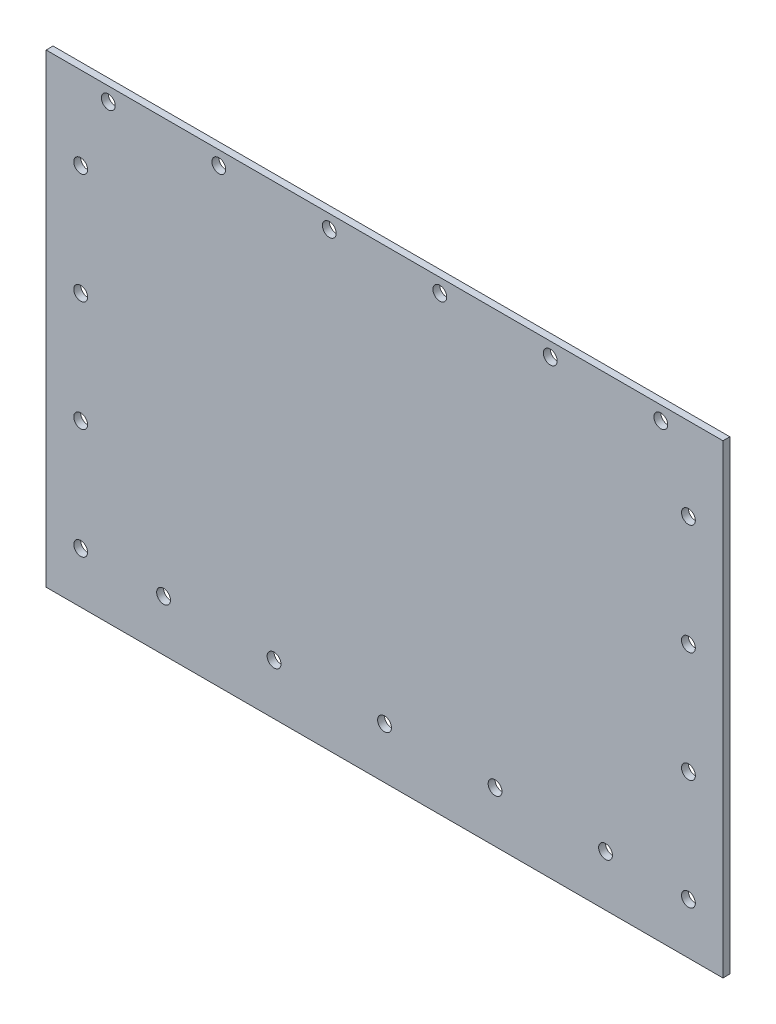
ISO-10303-21;
HEADER;
FILE_DESCRIPTION(('STEP AP214'),'2;1');
FILE_NAME('part.step','',(''),(''),'','','');
FILE_SCHEMA(('AUTOMOTIVE_DESIGN { 1 0 10303 214 1 1 1 1 }'));
ENDSEC;
DATA;
#1=APPLICATION_CONTEXT('core data for automotive mechanical design processes');
#2=APPLICATION_PROTOCOL_DEFINITION('international standard','automotive_design',2000,#1);
#3=PRODUCT_CONTEXT('',#1,'mechanical');
#4=PRODUCT('Part','Part','',(#3));
#5=PRODUCT_RELATED_PRODUCT_CATEGORY('part','',(#4));
#6=PRODUCT_DEFINITION_FORMATION('','',#4);
#7=PRODUCT_DEFINITION_CONTEXT('part definition',#1,'design');
#8=PRODUCT_DEFINITION('design','',#6,#7);
#9=PRODUCT_DEFINITION_SHAPE('','',#8);
#10=(LENGTH_UNIT() NAMED_UNIT(*) SI_UNIT(.MILLI.,.METRE.));
#11=(NAMED_UNIT(*) PLANE_ANGLE_UNIT() SI_UNIT($,.RADIAN.));
#12=(NAMED_UNIT(*) SI_UNIT($,.STERADIAN.) SOLID_ANGLE_UNIT());
#13=UNCERTAINTY_MEASURE_WITH_UNIT(LENGTH_MEASURE(1.E-05),#10,'distance_accuracy_value','');
#14=(GEOMETRIC_REPRESENTATION_CONTEXT(3) GLOBAL_UNCERTAINTY_ASSIGNED_CONTEXT((#13)) GLOBAL_UNIT_ASSIGNED_CONTEXT((#10,
#11,#12)) REPRESENTATION_CONTEXT('',''));
#15=CARTESIAN_POINT('',(0.,0.,0.));
#16=DIRECTION('',(0.,0.,1.));
#17=DIRECTION('',(1.,0.,0.));
#18=AXIS2_PLACEMENT_3D('',#15,#16,#17);
#19=CARTESIAN_POINT('',(155.58,0.,1.5875));
#20=DIRECTION('',(1.,0.,0.));
#21=DIRECTION('',(0.,0.,-1.));
#22=AXIS2_PLACEMENT_3D('',#19,#20,#21);
#23=PLANE('',#22);
#24=DIRECTION('',(0.,-1.,0.));
#25=VECTOR('',#24,1.);
#26=CARTESIAN_POINT('',(155.58,0.,0.));
#27=LINE('',#26,#25);
#28=CARTESIAN_POINT('',(155.58,0.,0.));
#29=VERTEX_POINT('',#28);
#30=CARTESIAN_POINT('',(155.58,-106.95,0.));
#31=VERTEX_POINT('',#30);
#32=EDGE_CURVE('E164',#29,#31,#27,.T.);
#33=ORIENTED_EDGE('',*,*,#32,.F.);
#34=DIRECTION('',(0.,0.,-1.));
#35=VECTOR('',#34,1.);
#36=CARTESIAN_POINT('',(155.58,0.,1.5875));
#37=LINE('',#36,#35);
#38=CARTESIAN_POINT('',(155.58,0.,1.5875));
#39=VERTEX_POINT('',#38);
#40=EDGE_CURVE('E11',#39,#29,#37,.T.);
#41=ORIENTED_EDGE('',*,*,#40,.F.);
#42=DIRECTION('',(0.,-1.,0.));
#43=VECTOR('',#42,1.);
#44=CARTESIAN_POINT('',(155.58,0.,1.5875));
#45=LINE('',#44,#43);
#46=CARTESIAN_POINT('',(155.58,-106.95,1.5875));
#47=VERTEX_POINT('',#46);
#48=EDGE_CURVE('E100',#39,#47,#45,.T.);
#49=ORIENTED_EDGE('',*,*,#48,.T.);
#50=DIRECTION('',(0.,0.,-1.));
#51=VECTOR('',#50,1.);
#52=CARTESIAN_POINT('',(155.58,-106.95,1.5875));
#53=LINE('',#52,#51);
#54=EDGE_CURVE('E79',#47,#31,#53,.T.);
#55=ORIENTED_EDGE('',*,*,#54,.T.);
#56=EDGE_LOOP('',(#33,#41,#49,#55));
#57=FACE_BOUND('',#56,.T.);
#58=ADVANCED_FACE('F39',(#57),#23,.T.);
#59=CARTESIAN_POINT('',(0.,0.,1.5875));
#60=DIRECTION('',(0.,1.,0.));
#61=DIRECTION('',(0.,0.,1.));
#62=AXIS2_PLACEMENT_3D('',#59,#60,#61);
#63=PLANE('',#62);
#64=DIRECTION('',(1.,0.,0.));
#65=VECTOR('',#64,1.);
#66=CARTESIAN_POINT('',(0.,0.,0.));
#67=LINE('',#66,#65);
#68=CARTESIAN_POINT('',(0.,0.,0.));
#69=VERTEX_POINT('',#68);
#70=EDGE_CURVE('E91',#69,#29,#67,.T.);
#71=ORIENTED_EDGE('',*,*,#70,.F.);
#72=DIRECTION('',(0.,0.,-1.));
#73=VECTOR('',#72,1.);
#74=CARTESIAN_POINT('',(0.,0.,1.5875));
#75=LINE('',#74,#73);
#76=CARTESIAN_POINT('',(0.,0.,1.5875));
#77=VERTEX_POINT('',#76);
#78=EDGE_CURVE('E48',#77,#69,#75,.T.);
#79=ORIENTED_EDGE('',*,*,#78,.F.);
#80=DIRECTION('',(1.,0.,0.));
#81=VECTOR('',#80,1.);
#82=CARTESIAN_POINT('',(0.,0.,1.5875));
#83=LINE('',#82,#81);
#84=EDGE_CURVE('E89',#77,#39,#83,.T.);
#85=ORIENTED_EDGE('',*,*,#84,.T.);
#86=ORIENTED_EDGE('',*,*,#40,.T.);
#87=EDGE_LOOP('',(#71,#79,#85,#86));
#88=FACE_BOUND('',#87,.T.);
#89=ADVANCED_FACE('F87',(#88),#63,.T.);
#90=CARTESIAN_POINT('',(0.,0.,1.5875));
#91=DIRECTION('',(1.,0.,0.));
#92=DIRECTION('',(0.,0.,-1.));
#93=AXIS2_PLACEMENT_3D('',#90,#91,#92);
#94=PLANE('',#93);
#95=DIRECTION('',(0.,-1.,0.));
#96=VECTOR('',#95,1.);
#97=CARTESIAN_POINT('',(0.,0.,0.));
#98=LINE('',#97,#96);
#99=CARTESIAN_POINT('',(0.,-106.95,0.));
#100=VERTEX_POINT('',#99);
#101=EDGE_CURVE('E167',#69,#100,#98,.T.);
#102=ORIENTED_EDGE('',*,*,#101,.T.);
#103=DIRECTION('',(0.,0.,-1.));
#104=VECTOR('',#103,1.);
#105=CARTESIAN_POINT('',(0.,-106.95,1.5875));
#106=LINE('',#105,#104);
#107=CARTESIAN_POINT('',(0.,-106.95,1.5875));
#108=VERTEX_POINT('',#107);
#109=EDGE_CURVE('E94',#108,#100,#106,.T.);
#110=ORIENTED_EDGE('',*,*,#109,.F.);
#111=DIRECTION('',(0.,-1.,0.));
#112=VECTOR('',#111,1.);
#113=CARTESIAN_POINT('',(0.,0.,1.5875));
#114=LINE('',#113,#112);
#115=EDGE_CURVE('E96',#77,#108,#114,.T.);
#116=ORIENTED_EDGE('',*,*,#115,.F.);
#117=ORIENTED_EDGE('',*,*,#78,.T.);
#118=EDGE_LOOP('',(#102,#110,#116,#117));
#119=FACE_BOUND('',#118,.T.);
#120=ADVANCED_FACE('F97',(#119),#94,.F.);
#121=CARTESIAN_POINT('',(7.94,-19.05,1.5875));
#122=DIRECTION('',(0.,0.,-1.));
#123=DIRECTION('',(-1.,0.,0.));
#124=AXIS2_PLACEMENT_3D('',#121,#122,#123);
#125=CYLINDRICAL_SURFACE('',#124,1.58749999999998);
#126=CARTESIAN_POINT('',(7.94,-19.05,1.5875));
#127=DIRECTION('',(0.,0.,1.));
#128=DIRECTION('',(1.,0.,0.));
#129=AXIS2_PLACEMENT_3D('',#126,#127,#128);
#130=CIRCLE('',#129,1.58749999999998);
#131=CARTESIAN_POINT('',(9.52749999999999,-19.05,1.5875));
#132=VERTEX_POINT('',#131);
#133=EDGE_CURVE('E102',#132,#132,#130,.T.);
#134=ORIENTED_EDGE('',*,*,#133,.T.);
#135=EDGE_LOOP('',(#134));
#136=FACE_BOUND('',#135,.T.);
#137=CARTESIAN_POINT('',(7.94,-19.05,0.));
#138=DIRECTION('',(0.,0.,1.));
#139=DIRECTION('',(1.,0.,0.));
#140=AXIS2_PLACEMENT_3D('',#137,#138,#139);
#141=CIRCLE('',#140,1.58749999999998);
#142=CARTESIAN_POINT('',(9.52749999999999,-19.05,0.));
#143=VERTEX_POINT('',#142);
#144=EDGE_CURVE('E161',#143,#143,#141,.T.);
#145=ORIENTED_EDGE('',*,*,#144,.F.);
#146=EDGE_LOOP('',(#145));
#147=FACE_BOUND('',#146,.T.);
#148=ADVANCED_FACE('F183',(#136,#147),#125,.F.);
#149=CARTESIAN_POINT('',(147.64,-19.05,1.5875));
#150=DIRECTION('',(0.,0.,-1.));
#151=DIRECTION('',(-1.,0.,0.));
#152=AXIS2_PLACEMENT_3D('',#149,#150,#151);
#153=CYLINDRICAL_SURFACE('',#152,1.58750000000004);
#154=CARTESIAN_POINT('',(147.64,-19.05,1.5875));
#155=DIRECTION('',(0.,0.,1.));
#156=DIRECTION('',(1.,0.,0.));
#157=AXIS2_PLACEMENT_3D('',#154,#155,#156);
#158=CIRCLE('',#157,1.58750000000004);
#159=CARTESIAN_POINT('',(149.2275,-19.05,1.5875));
#160=VERTEX_POINT('',#159);
#161=EDGE_CURVE('E538',#160,#160,#158,.T.);
#162=ORIENTED_EDGE('',*,*,#161,.T.);
#163=EDGE_LOOP('',(#162));
#164=FACE_BOUND('',#163,.T.);
#165=CARTESIAN_POINT('',(147.64,-19.05,0.));
#166=DIRECTION('',(0.,0.,1.));
#167=DIRECTION('',(1.,0.,0.));
#168=AXIS2_PLACEMENT_3D('',#165,#166,#167);
#169=CIRCLE('',#168,1.58750000000004);
#170=CARTESIAN_POINT('',(149.2275,-19.05,0.));
#171=VERTEX_POINT('',#170);
#172=EDGE_CURVE('E158',#171,#171,#169,.T.);
#173=ORIENTED_EDGE('',*,*,#172,.F.);
#174=EDGE_LOOP('',(#173));
#175=FACE_BOUND('',#174,.T.);
#176=ADVANCED_FACE('F186',(#164,#175),#153,.F.);
#177=CARTESIAN_POINT('',(147.64,-44.45,1.5875));
#178=DIRECTION('',(0.,0.,-1.));
#179=DIRECTION('',(-1.,0.,0.));
#180=AXIS2_PLACEMENT_3D('',#177,#178,#179);
#181=CYLINDRICAL_SURFACE('',#180,1.58750000000004);
#182=CARTESIAN_POINT('',(147.64,-44.45,1.5875));
#183=DIRECTION('',(0.,0.,1.));
#184=DIRECTION('',(1.,0.,0.));
#185=AXIS2_PLACEMENT_3D('',#182,#183,#184);
#186=CIRCLE('',#185,1.58750000000004);
#187=CARTESIAN_POINT('',(149.2275,-44.45,1.5875));
#188=VERTEX_POINT('',#187);
#189=EDGE_CURVE('E534',#188,#188,#186,.T.);
#190=ORIENTED_EDGE('',*,*,#189,.T.);
#191=EDGE_LOOP('',(#190));
#192=FACE_BOUND('',#191,.T.);
#193=CARTESIAN_POINT('',(147.64,-44.45,0.));
#194=DIRECTION('',(0.,0.,1.));
#195=DIRECTION('',(1.,0.,0.));
#196=AXIS2_PLACEMENT_3D('',#193,#194,#195);
#197=CIRCLE('',#196,1.58750000000004);
#198=CARTESIAN_POINT('',(149.2275,-44.45,0.));
#199=VERTEX_POINT('',#198);
#200=EDGE_CURVE('E155',#199,#199,#197,.T.);
#201=ORIENTED_EDGE('',*,*,#200,.F.);
#202=EDGE_LOOP('',(#201));
#203=FACE_BOUND('',#202,.T.);
#204=ADVANCED_FACE('F190',(#192,#203),#181,.F.);
#205=CARTESIAN_POINT('',(147.64,-69.85,1.5875));
#206=DIRECTION('',(0.,0.,-1.));
#207=DIRECTION('',(-1.,0.,0.));
#208=AXIS2_PLACEMENT_3D('',#205,#206,#207);
#209=CYLINDRICAL_SURFACE('',#208,1.58750000000004);
#210=CARTESIAN_POINT('',(147.64,-69.85,1.5875));
#211=DIRECTION('',(0.,0.,1.));
#212=DIRECTION('',(1.,0.,0.));
#213=AXIS2_PLACEMENT_3D('',#210,#211,#212);
#214=CIRCLE('',#213,1.58750000000004);
#215=CARTESIAN_POINT('',(149.2275,-69.85,1.5875));
#216=VERTEX_POINT('',#215);
#217=EDGE_CURVE('E530',#216,#216,#214,.T.);
#218=ORIENTED_EDGE('',*,*,#217,.T.);
#219=EDGE_LOOP('',(#218));
#220=FACE_BOUND('',#219,.T.);
#221=CARTESIAN_POINT('',(147.64,-69.85,0.));
#222=DIRECTION('',(0.,0.,1.));
#223=DIRECTION('',(1.,0.,0.));
#224=AXIS2_PLACEMENT_3D('',#221,#222,#223);
#225=CIRCLE('',#224,1.58750000000004);
#226=CARTESIAN_POINT('',(149.2275,-69.85,0.));
#227=VERTEX_POINT('',#226);
#228=EDGE_CURVE('E152',#227,#227,#225,.T.);
#229=ORIENTED_EDGE('',*,*,#228,.F.);
#230=EDGE_LOOP('',(#229));
#231=FACE_BOUND('',#230,.T.);
#232=ADVANCED_FACE('F194',(#220,#231),#209,.F.);
#233=CARTESIAN_POINT('',(147.64,-95.25,1.5875));
#234=DIRECTION('',(0.,0.,-1.));
#235=DIRECTION('',(-1.,0.,0.));
#236=AXIS2_PLACEMENT_3D('',#233,#234,#235);
#237=CYLINDRICAL_SURFACE('',#236,1.58750000000004);
#238=CARTESIAN_POINT('',(147.64,-95.25,1.5875));
#239=DIRECTION('',(0.,0.,1.));
#240=DIRECTION('',(1.,0.,0.));
#241=AXIS2_PLACEMENT_3D('',#238,#239,#240);
#242=CIRCLE('',#241,1.58750000000004);
#243=CARTESIAN_POINT('',(149.2275,-95.25,1.5875));
#244=VERTEX_POINT('',#243);
#245=EDGE_CURVE('E526',#244,#244,#242,.T.);
#246=ORIENTED_EDGE('',*,*,#245,.T.);
#247=EDGE_LOOP('',(#246));
#248=FACE_BOUND('',#247,.T.);
#249=CARTESIAN_POINT('',(147.64,-95.25,0.));
#250=DIRECTION('',(0.,0.,1.));
#251=DIRECTION('',(1.,0.,0.));
#252=AXIS2_PLACEMENT_3D('',#249,#250,#251);
#253=CIRCLE('',#252,1.58750000000004);
#254=CARTESIAN_POINT('',(149.2275,-95.25,0.));
#255=VERTEX_POINT('',#254);
#256=EDGE_CURVE('E149',#255,#255,#253,.T.);
#257=ORIENTED_EDGE('',*,*,#256,.F.);
#258=EDGE_LOOP('',(#257));
#259=FACE_BOUND('',#258,.T.);
#260=ADVANCED_FACE('F198',(#248,#259),#237,.F.);
#261=CARTESIAN_POINT('',(7.94000000000001,-44.45,1.5875));
#262=DIRECTION('',(0.,0.,-1.));
#263=DIRECTION('',(-1.,0.,0.));
#264=AXIS2_PLACEMENT_3D('',#261,#262,#263);
#265=CYLINDRICAL_SURFACE('',#264,1.58749999999999);
#266=CARTESIAN_POINT('',(7.94000000000001,-44.45,1.5875));
#267=DIRECTION('',(0.,0.,1.));
#268=DIRECTION('',(1.,0.,0.));
#269=AXIS2_PLACEMENT_3D('',#266,#267,#268);
#270=CIRCLE('',#269,1.58749999999999);
#271=CARTESIAN_POINT('',(9.52749999999999,-44.45,1.5875));
#272=VERTEX_POINT('',#271);
#273=EDGE_CURVE('E522',#272,#272,#270,.T.);
#274=ORIENTED_EDGE('',*,*,#273,.T.);
#275=EDGE_LOOP('',(#274));
#276=FACE_BOUND('',#275,.T.);
#277=CARTESIAN_POINT('',(7.94000000000001,-44.45,0.));
#278=DIRECTION('',(0.,0.,1.));
#279=DIRECTION('',(1.,0.,0.));
#280=AXIS2_PLACEMENT_3D('',#277,#278,#279);
#281=CIRCLE('',#280,1.58749999999999);
#282=CARTESIAN_POINT('',(9.52749999999999,-44.45,0.));
#283=VERTEX_POINT('',#282);
#284=EDGE_CURVE('E146',#283,#283,#281,.T.);
#285=ORIENTED_EDGE('',*,*,#284,.F.);
#286=EDGE_LOOP('',(#285));
#287=FACE_BOUND('',#286,.T.);
#288=ADVANCED_FACE('F202',(#276,#287),#265,.F.);
#289=CARTESIAN_POINT('',(7.94000000000001,-69.85,1.5875));
#290=DIRECTION('',(0.,0.,-1.));
#291=DIRECTION('',(-1.,0.,0.));
#292=AXIS2_PLACEMENT_3D('',#289,#290,#291);
#293=CYLINDRICAL_SURFACE('',#292,1.58749999999999);
#294=CARTESIAN_POINT('',(7.94000000000001,-69.85,1.5875));
#295=DIRECTION('',(0.,0.,1.));
#296=DIRECTION('',(1.,0.,0.));
#297=AXIS2_PLACEMENT_3D('',#294,#295,#296);
#298=CIRCLE('',#297,1.58749999999999);
#299=CARTESIAN_POINT('',(9.52749999999999,-69.85,1.5875));
#300=VERTEX_POINT('',#299);
#301=EDGE_CURVE('E518',#300,#300,#298,.T.);
#302=ORIENTED_EDGE('',*,*,#301,.T.);
#303=EDGE_LOOP('',(#302));
#304=FACE_BOUND('',#303,.T.);
#305=CARTESIAN_POINT('',(7.94000000000001,-69.85,0.));
#306=DIRECTION('',(0.,0.,1.));
#307=DIRECTION('',(1.,0.,0.));
#308=AXIS2_PLACEMENT_3D('',#305,#306,#307);
#309=CIRCLE('',#308,1.58749999999999);
#310=CARTESIAN_POINT('',(9.52749999999999,-69.85,0.));
#311=VERTEX_POINT('',#310);
#312=EDGE_CURVE('E143',#311,#311,#309,.T.);
#313=ORIENTED_EDGE('',*,*,#312,.F.);
#314=EDGE_LOOP('',(#313));
#315=FACE_BOUND('',#314,.T.);
#316=ADVANCED_FACE('F206',(#304,#315),#293,.F.);
#317=CARTESIAN_POINT('',(7.94000000000001,-95.25,1.5875));
#318=DIRECTION('',(0.,0.,-1.));
#319=DIRECTION('',(-1.,0.,0.));
#320=AXIS2_PLACEMENT_3D('',#317,#318,#319);
#321=CYLINDRICAL_SURFACE('',#320,1.58749999999999);
#322=CARTESIAN_POINT('',(7.94000000000001,-95.25,1.5875));
#323=DIRECTION('',(0.,0.,1.));
#324=DIRECTION('',(1.,0.,0.));
#325=AXIS2_PLACEMENT_3D('',#322,#323,#324);
#326=CIRCLE('',#325,1.58749999999999);
#327=CARTESIAN_POINT('',(9.52749999999999,-95.25,1.5875));
#328=VERTEX_POINT('',#327);
#329=EDGE_CURVE('E514',#328,#328,#326,.T.);
#330=ORIENTED_EDGE('',*,*,#329,.T.);
#331=EDGE_LOOP('',(#330));
#332=FACE_BOUND('',#331,.T.);
#333=CARTESIAN_POINT('',(7.94000000000001,-95.25,0.));
#334=DIRECTION('',(0.,0.,1.));
#335=DIRECTION('',(1.,0.,0.));
#336=AXIS2_PLACEMENT_3D('',#333,#334,#335);
#337=CIRCLE('',#336,1.58749999999999);
#338=CARTESIAN_POINT('',(9.52749999999999,-95.25,0.));
#339=VERTEX_POINT('',#338);
#340=EDGE_CURVE('E140',#339,#339,#337,.T.);
#341=ORIENTED_EDGE('',*,*,#340,.F.);
#342=EDGE_LOOP('',(#341));
#343=FACE_BOUND('',#342,.T.);
#344=ADVANCED_FACE('F210',(#332,#343),#321,.F.);
#345=CARTESIAN_POINT('',(14.29,-3.175,1.5875));
#346=DIRECTION('',(0.,0.,-1.));
#347=DIRECTION('',(-1.,0.,0.));
#348=AXIS2_PLACEMENT_3D('',#345,#346,#347);
#349=CYLINDRICAL_SURFACE('',#348,1.58749999999998);
#350=CARTESIAN_POINT('',(14.29,-3.175,1.5875));
#351=DIRECTION('',(0.,0.,1.));
#352=DIRECTION('',(1.,0.,0.));
#353=AXIS2_PLACEMENT_3D('',#350,#351,#352);
#354=CIRCLE('',#353,1.58749999999998);
#355=CARTESIAN_POINT('',(15.8775,-3.175,1.5875));
#356=VERTEX_POINT('',#355);
#357=EDGE_CURVE('E510',#356,#356,#354,.T.);
#358=ORIENTED_EDGE('',*,*,#357,.T.);
#359=EDGE_LOOP('',(#358));
#360=FACE_BOUND('',#359,.T.);
#361=CARTESIAN_POINT('',(14.29,-3.175,0.));
#362=DIRECTION('',(0.,0.,1.));
#363=DIRECTION('',(1.,0.,0.));
#364=AXIS2_PLACEMENT_3D('',#361,#362,#363);
#365=CIRCLE('',#364,1.58749999999998);
#366=CARTESIAN_POINT('',(15.8775,-3.175,0.));
#367=VERTEX_POINT('',#366);
#368=EDGE_CURVE('E137',#367,#367,#365,.T.);
#369=ORIENTED_EDGE('',*,*,#368,.F.);
#370=EDGE_LOOP('',(#369));
#371=FACE_BOUND('',#370,.T.);
#372=ADVANCED_FACE('F214',(#360,#371),#349,.F.);
#373=CARTESIAN_POINT('',(39.69,-3.175,1.5875));
#374=DIRECTION('',(0.,0.,-1.));
#375=DIRECTION('',(-1.,0.,0.));
#376=AXIS2_PLACEMENT_3D('',#373,#374,#375);
#377=CYLINDRICAL_SURFACE('',#376,1.58749999999998);
#378=CARTESIAN_POINT('',(39.69,-3.175,1.5875));
#379=DIRECTION('',(0.,0.,1.));
#380=DIRECTION('',(1.,0.,0.));
#381=AXIS2_PLACEMENT_3D('',#378,#379,#380);
#382=CIRCLE('',#381,1.58749999999998);
#383=CARTESIAN_POINT('',(41.2775,-3.175,1.5875));
#384=VERTEX_POINT('',#383);
#385=EDGE_CURVE('E506',#384,#384,#382,.T.);
#386=ORIENTED_EDGE('',*,*,#385,.T.);
#387=EDGE_LOOP('',(#386));
#388=FACE_BOUND('',#387,.T.);
#389=CARTESIAN_POINT('',(39.69,-3.175,0.));
#390=DIRECTION('',(0.,0.,1.));
#391=DIRECTION('',(1.,0.,0.));
#392=AXIS2_PLACEMENT_3D('',#389,#390,#391);
#393=CIRCLE('',#392,1.58749999999998);
#394=CARTESIAN_POINT('',(41.2775,-3.175,0.));
#395=VERTEX_POINT('',#394);
#396=EDGE_CURVE('E134',#395,#395,#393,.T.);
#397=ORIENTED_EDGE('',*,*,#396,.F.);
#398=EDGE_LOOP('',(#397));
#399=FACE_BOUND('',#398,.T.);
#400=ADVANCED_FACE('F218',(#388,#399),#377,.F.);
#401=CARTESIAN_POINT('',(65.09,-3.175,1.5875));
#402=DIRECTION('',(0.,0.,-1.));
#403=DIRECTION('',(-1.,0.,0.));
#404=AXIS2_PLACEMENT_3D('',#401,#402,#403);
#405=CYLINDRICAL_SURFACE('',#404,1.5875);
#406=CARTESIAN_POINT('',(65.09,-3.175,1.5875));
#407=DIRECTION('',(0.,0.,1.));
#408=DIRECTION('',(1.,0.,0.));
#409=AXIS2_PLACEMENT_3D('',#406,#407,#408);
#410=CIRCLE('',#409,1.5875);
#411=CARTESIAN_POINT('',(66.6775,-3.175,1.5875));
#412=VERTEX_POINT('',#411);
#413=EDGE_CURVE('E502',#412,#412,#410,.T.);
#414=ORIENTED_EDGE('',*,*,#413,.T.);
#415=EDGE_LOOP('',(#414));
#416=FACE_BOUND('',#415,.T.);
#417=CARTESIAN_POINT('',(65.09,-3.175,0.));
#418=DIRECTION('',(0.,0.,1.));
#419=DIRECTION('',(1.,0.,0.));
#420=AXIS2_PLACEMENT_3D('',#417,#418,#419);
#421=CIRCLE('',#420,1.5875);
#422=CARTESIAN_POINT('',(66.6775,-3.175,0.));
#423=VERTEX_POINT('',#422);
#424=EDGE_CURVE('E131',#423,#423,#421,.T.);
#425=ORIENTED_EDGE('',*,*,#424,.F.);
#426=EDGE_LOOP('',(#425));
#427=FACE_BOUND('',#426,.T.);
#428=ADVANCED_FACE('F222',(#416,#427),#405,.F.);
#429=CARTESIAN_POINT('',(90.49,-3.175,1.5875));
#430=DIRECTION('',(0.,0.,-1.));
#431=DIRECTION('',(-1.,0.,0.));
#432=AXIS2_PLACEMENT_3D('',#429,#430,#431);
#433=CYLINDRICAL_SURFACE('',#432,1.58749999999999);
#434=CARTESIAN_POINT('',(90.49,-3.175,1.5875));
#435=DIRECTION('',(0.,0.,1.));
#436=DIRECTION('',(1.,0.,0.));
#437=AXIS2_PLACEMENT_3D('',#434,#435,#436);
#438=CIRCLE('',#437,1.58749999999999);
#439=CARTESIAN_POINT('',(92.0775,-3.175,1.5875));
#440=VERTEX_POINT('',#439);
#441=EDGE_CURVE('E498',#440,#440,#438,.T.);
#442=ORIENTED_EDGE('',*,*,#441,.T.);
#443=EDGE_LOOP('',(#442));
#444=FACE_BOUND('',#443,.T.);
#445=CARTESIAN_POINT('',(90.49,-3.175,0.));
#446=DIRECTION('',(0.,0.,1.));
#447=DIRECTION('',(1.,0.,0.));
#448=AXIS2_PLACEMENT_3D('',#445,#446,#447);
#449=CIRCLE('',#448,1.58749999999999);
#450=CARTESIAN_POINT('',(92.0775,-3.175,0.));
#451=VERTEX_POINT('',#450);
#452=EDGE_CURVE('E128',#451,#451,#449,.T.);
#453=ORIENTED_EDGE('',*,*,#452,.F.);
#454=EDGE_LOOP('',(#453));
#455=FACE_BOUND('',#454,.T.);
#456=ADVANCED_FACE('F226',(#444,#455),#433,.F.);
#457=CARTESIAN_POINT('',(115.89,-3.175,1.5875));
#458=DIRECTION('',(0.,0.,-1.));
#459=DIRECTION('',(-1.,0.,0.));
#460=AXIS2_PLACEMENT_3D('',#457,#458,#459);
#461=CYLINDRICAL_SURFACE('',#460,1.58749999999999);
#462=CARTESIAN_POINT('',(115.89,-3.175,1.5875));
#463=DIRECTION('',(0.,0.,1.));
#464=DIRECTION('',(1.,0.,0.));
#465=AXIS2_PLACEMENT_3D('',#462,#463,#464);
#466=CIRCLE('',#465,1.58749999999999);
#467=CARTESIAN_POINT('',(117.4775,-3.175,1.5875));
#468=VERTEX_POINT('',#467);
#469=EDGE_CURVE('E494',#468,#468,#466,.T.);
#470=ORIENTED_EDGE('',*,*,#469,.T.);
#471=EDGE_LOOP('',(#470));
#472=FACE_BOUND('',#471,.T.);
#473=CARTESIAN_POINT('',(115.89,-3.175,0.));
#474=DIRECTION('',(0.,0.,1.));
#475=DIRECTION('',(1.,0.,0.));
#476=AXIS2_PLACEMENT_3D('',#473,#474,#475);
#477=CIRCLE('',#476,1.58749999999999);
#478=CARTESIAN_POINT('',(117.4775,-3.175,0.));
#479=VERTEX_POINT('',#478);
#480=EDGE_CURVE('E125',#479,#479,#477,.T.);
#481=ORIENTED_EDGE('',*,*,#480,.F.);
#482=EDGE_LOOP('',(#481));
#483=FACE_BOUND('',#482,.T.);
#484=ADVANCED_FACE('F230',(#472,#483),#461,.F.);
#485=CARTESIAN_POINT('',(141.29,-3.175,1.5875));
#486=DIRECTION('',(0.,0.,-1.));
#487=DIRECTION('',(-1.,0.,0.));
#488=AXIS2_PLACEMENT_3D('',#485,#486,#487);
#489=CYLINDRICAL_SURFACE('',#488,1.58750000000004);
#490=CARTESIAN_POINT('',(141.29,-3.175,1.5875));
#491=DIRECTION('',(0.,0.,1.));
#492=DIRECTION('',(1.,0.,0.));
#493=AXIS2_PLACEMENT_3D('',#490,#491,#492);
#494=CIRCLE('',#493,1.58750000000004);
#495=CARTESIAN_POINT('',(142.8775,-3.175,1.5875));
#496=VERTEX_POINT('',#495);
#497=EDGE_CURVE('E490',#496,#496,#494,.T.);
#498=ORIENTED_EDGE('',*,*,#497,.T.);
#499=EDGE_LOOP('',(#498));
#500=FACE_BOUND('',#499,.T.);
#501=CARTESIAN_POINT('',(141.29,-3.175,0.));
#502=DIRECTION('',(0.,0.,1.));
#503=DIRECTION('',(1.,0.,0.));
#504=AXIS2_PLACEMENT_3D('',#501,#502,#503);
#505=CIRCLE('',#504,1.58750000000004);
#506=CARTESIAN_POINT('',(142.8775,-3.175,0.));
#507=VERTEX_POINT('',#506);
#508=EDGE_CURVE('E122',#507,#507,#505,.T.);
#509=ORIENTED_EDGE('',*,*,#508,.F.);
#510=EDGE_LOOP('',(#509));
#511=FACE_BOUND('',#510,.T.);
#512=ADVANCED_FACE('F234',(#500,#511),#489,.F.);
#513=CARTESIAN_POINT('',(26.99,-95.25,1.5875));
#514=DIRECTION('',(0.,0.,-1.));
#515=DIRECTION('',(-1.,0.,0.));
#516=AXIS2_PLACEMENT_3D('',#513,#514,#515);
#517=CYLINDRICAL_SURFACE('',#516,1.5875);
#518=CARTESIAN_POINT('',(26.99,-95.25,1.5875));
#519=DIRECTION('',(0.,0.,1.));
#520=DIRECTION('',(1.,0.,0.));
#521=AXIS2_PLACEMENT_3D('',#518,#519,#520);
#522=CIRCLE('',#521,1.5875);
#523=CARTESIAN_POINT('',(28.5775,-95.25,1.5875));
#524=VERTEX_POINT('',#523);
#525=EDGE_CURVE('E486',#524,#524,#522,.T.);
#526=ORIENTED_EDGE('',*,*,#525,.T.);
#527=EDGE_LOOP('',(#526));
#528=FACE_BOUND('',#527,.T.);
#529=CARTESIAN_POINT('',(26.99,-95.25,0.));
#530=DIRECTION('',(0.,0.,1.));
#531=DIRECTION('',(1.,0.,0.));
#532=AXIS2_PLACEMENT_3D('',#529,#530,#531);
#533=CIRCLE('',#532,1.5875);
#534=CARTESIAN_POINT('',(28.5775,-95.25,0.));
#535=VERTEX_POINT('',#534);
#536=EDGE_CURVE('E119',#535,#535,#533,.T.);
#537=ORIENTED_EDGE('',*,*,#536,.F.);
#538=EDGE_LOOP('',(#537));
#539=FACE_BOUND('',#538,.T.);
#540=ADVANCED_FACE('F238',(#528,#539),#517,.F.);
#541=CARTESIAN_POINT('',(52.39,-95.25,1.5875));
#542=DIRECTION('',(0.,0.,-1.));
#543=DIRECTION('',(-1.,0.,0.));
#544=AXIS2_PLACEMENT_3D('',#541,#542,#543);
#545=CYLINDRICAL_SURFACE('',#544,1.58749999999999);
#546=CARTESIAN_POINT('',(52.39,-95.25,1.5875));
#547=DIRECTION('',(0.,0.,1.));
#548=DIRECTION('',(1.,0.,0.));
#549=AXIS2_PLACEMENT_3D('',#546,#547,#548);
#550=CIRCLE('',#549,1.58749999999999);
#551=CARTESIAN_POINT('',(53.9775,-95.25,1.5875));
#552=VERTEX_POINT('',#551);
#553=EDGE_CURVE('E482',#552,#552,#550,.T.);
#554=ORIENTED_EDGE('',*,*,#553,.T.);
#555=EDGE_LOOP('',(#554));
#556=FACE_BOUND('',#555,.T.);
#557=CARTESIAN_POINT('',(52.39,-95.25,0.));
#558=DIRECTION('',(0.,0.,1.));
#559=DIRECTION('',(1.,0.,0.));
#560=AXIS2_PLACEMENT_3D('',#557,#558,#559);
#561=CIRCLE('',#560,1.58749999999999);
#562=CARTESIAN_POINT('',(53.9775,-95.25,0.));
#563=VERTEX_POINT('',#562);
#564=EDGE_CURVE('E116',#563,#563,#561,.T.);
#565=ORIENTED_EDGE('',*,*,#564,.F.);
#566=EDGE_LOOP('',(#565));
#567=FACE_BOUND('',#566,.T.);
#568=ADVANCED_FACE('F242',(#556,#567),#545,.F.);
#569=CARTESIAN_POINT('',(77.79,-95.25,1.5875));
#570=DIRECTION('',(0.,0.,-1.));
#571=DIRECTION('',(-1.,0.,0.));
#572=AXIS2_PLACEMENT_3D('',#569,#570,#571);
#573=CYLINDRICAL_SURFACE('',#572,1.58749999999999);
#574=CARTESIAN_POINT('',(77.79,-95.25,1.5875));
#575=DIRECTION('',(0.,0.,1.));
#576=DIRECTION('',(1.,0.,0.));
#577=AXIS2_PLACEMENT_3D('',#574,#575,#576);
#578=CIRCLE('',#577,1.58749999999999);
#579=CARTESIAN_POINT('',(79.3775,-95.25,1.5875));
#580=VERTEX_POINT('',#579);
#581=EDGE_CURVE('E478',#580,#580,#578,.T.);
#582=ORIENTED_EDGE('',*,*,#581,.T.);
#583=EDGE_LOOP('',(#582));
#584=FACE_BOUND('',#583,.T.);
#585=CARTESIAN_POINT('',(77.79,-95.25,0.));
#586=DIRECTION('',(0.,0.,1.));
#587=DIRECTION('',(1.,0.,0.));
#588=AXIS2_PLACEMENT_3D('',#585,#586,#587);
#589=CIRCLE('',#588,1.58749999999999);
#590=CARTESIAN_POINT('',(79.3775,-95.25,0.));
#591=VERTEX_POINT('',#590);
#592=EDGE_CURVE('E113',#591,#591,#589,.T.);
#593=ORIENTED_EDGE('',*,*,#592,.F.);
#594=EDGE_LOOP('',(#593));
#595=FACE_BOUND('',#594,.T.);
#596=ADVANCED_FACE('F246',(#584,#595),#573,.F.);
#597=CARTESIAN_POINT('',(103.19,-95.25,1.5875));
#598=DIRECTION('',(0.,0.,-1.));
#599=DIRECTION('',(-1.,0.,0.));
#600=AXIS2_PLACEMENT_3D('',#597,#598,#599);
#601=CYLINDRICAL_SURFACE('',#600,1.58749999999999);
#602=CARTESIAN_POINT('',(103.19,-95.25,1.5875));
#603=DIRECTION('',(0.,0.,1.));
#604=DIRECTION('',(1.,0.,0.));
#605=AXIS2_PLACEMENT_3D('',#602,#603,#604);
#606=CIRCLE('',#605,1.58749999999999);
#607=CARTESIAN_POINT('',(104.7775,-95.25,1.5875));
#608=VERTEX_POINT('',#607);
#609=EDGE_CURVE('E260',#608,#608,#606,.T.);
#610=ORIENTED_EDGE('',*,*,#609,.T.);
#611=EDGE_LOOP('',(#610));
#612=FACE_BOUND('',#611,.T.);
#613=CARTESIAN_POINT('',(103.19,-95.25,0.));
#614=DIRECTION('',(0.,0.,1.));
#615=DIRECTION('',(1.,0.,0.));
#616=AXIS2_PLACEMENT_3D('',#613,#614,#615);
#617=CIRCLE('',#616,1.58749999999999);
#618=CARTESIAN_POINT('',(104.7775,-95.25,0.));
#619=VERTEX_POINT('',#618);
#620=EDGE_CURVE('E110',#619,#619,#617,.T.);
#621=ORIENTED_EDGE('',*,*,#620,.F.);
#622=EDGE_LOOP('',(#621));
#623=FACE_BOUND('',#622,.T.);
#624=ADVANCED_FACE('F249',(#612,#623),#601,.F.);
#625=CARTESIAN_POINT('',(128.59,-95.25,1.5875));
#626=DIRECTION('',(0.,0.,-1.));
#627=DIRECTION('',(-1.,0.,0.));
#628=AXIS2_PLACEMENT_3D('',#625,#626,#627);
#629=CYLINDRICAL_SURFACE('',#628,1.58750000000004);
#630=CARTESIAN_POINT('',(128.59,-95.25,1.5875));
#631=DIRECTION('',(0.,0.,1.));
#632=DIRECTION('',(1.,0.,0.));
#633=AXIS2_PLACEMENT_3D('',#630,#631,#632);
#634=CIRCLE('',#633,1.58750000000004);
#635=CARTESIAN_POINT('',(130.1775,-95.25,1.5875));
#636=VERTEX_POINT('',#635);
#637=EDGE_CURVE('E170',#636,#636,#634,.T.);
#638=ORIENTED_EDGE('',*,*,#637,.T.);
#639=EDGE_LOOP('',(#638));
#640=FACE_BOUND('',#639,.T.);
#641=CARTESIAN_POINT('',(128.59,-95.25,0.));
#642=DIRECTION('',(0.,0.,1.));
#643=DIRECTION('',(1.,0.,0.));
#644=AXIS2_PLACEMENT_3D('',#641,#642,#643);
#645=CIRCLE('',#644,1.58750000000004);
#646=CARTESIAN_POINT('',(130.1775,-95.25,0.));
#647=VERTEX_POINT('',#646);
#648=EDGE_CURVE('E107',#647,#647,#645,.T.);
#649=ORIENTED_EDGE('',*,*,#648,.F.);
#650=EDGE_LOOP('',(#649));
#651=FACE_BOUND('',#650,.T.);
#652=ADVANCED_FACE('F41',(#640,#651),#629,.F.);
#653=CARTESIAN_POINT('',(0.,-106.95,1.5875));
#654=DIRECTION('',(0.,1.,0.));
#655=DIRECTION('',(0.,0.,1.));
#656=AXIS2_PLACEMENT_3D('',#653,#654,#655);
#657=PLANE('',#656);
#658=DIRECTION('',(1.,0.,0.));
#659=VECTOR('',#658,1.);
#660=CARTESIAN_POINT('',(0.,-106.95,0.));
#661=LINE('',#660,#659);
#662=EDGE_CURVE('E72',#100,#31,#661,.T.);
#663=ORIENTED_EDGE('',*,*,#662,.T.);
#664=ORIENTED_EDGE('',*,*,#54,.F.);
#665=DIRECTION('',(1.,0.,0.));
#666=VECTOR('',#665,1.);
#667=CARTESIAN_POINT('',(0.,-106.95,1.5875));
#668=LINE('',#667,#666);
#669=EDGE_CURVE('E56',#108,#47,#668,.T.);
#670=ORIENTED_EDGE('',*,*,#669,.F.);
#671=ORIENTED_EDGE('',*,*,#109,.T.);
#672=EDGE_LOOP('',(#663,#664,#670,#671));
#673=FACE_BOUND('',#672,.T.);
#674=ADVANCED_FACE('F173',(#673),#657,.F.);
#675=CARTESIAN_POINT('',(0.,0.,1.5875));
#676=DIRECTION('',(0.,0.,1.));
#677=DIRECTION('',(1.,0.,0.));
#678=AXIS2_PLACEMENT_3D('',#675,#676,#677);
#679=PLANE('',#678);
#680=ORIENTED_EDGE('',*,*,#637,.F.);
#681=EDGE_LOOP('',(#680));
#682=FACE_BOUND('',#681,.T.);
#683=ORIENTED_EDGE('',*,*,#609,.F.);
#684=EDGE_LOOP('',(#683));
#685=FACE_BOUND('',#684,.T.);
#686=ORIENTED_EDGE('',*,*,#581,.F.);
#687=EDGE_LOOP('',(#686));
#688=FACE_BOUND('',#687,.T.);
#689=ORIENTED_EDGE('',*,*,#553,.F.);
#690=EDGE_LOOP('',(#689));
#691=FACE_BOUND('',#690,.T.);
#692=ORIENTED_EDGE('',*,*,#525,.F.);
#693=EDGE_LOOP('',(#692));
#694=FACE_BOUND('',#693,.T.);
#695=ORIENTED_EDGE('',*,*,#497,.F.);
#696=EDGE_LOOP('',(#695));
#697=FACE_BOUND('',#696,.T.);
#698=ORIENTED_EDGE('',*,*,#469,.F.);
#699=EDGE_LOOP('',(#698));
#700=FACE_BOUND('',#699,.T.);
#701=ORIENTED_EDGE('',*,*,#441,.F.);
#702=EDGE_LOOP('',(#701));
#703=FACE_BOUND('',#702,.T.);
#704=ORIENTED_EDGE('',*,*,#413,.F.);
#705=EDGE_LOOP('',(#704));
#706=FACE_BOUND('',#705,.T.);
#707=ORIENTED_EDGE('',*,*,#385,.F.);
#708=EDGE_LOOP('',(#707));
#709=FACE_BOUND('',#708,.T.);
#710=ORIENTED_EDGE('',*,*,#357,.F.);
#711=EDGE_LOOP('',(#710));
#712=FACE_BOUND('',#711,.T.);
#713=ORIENTED_EDGE('',*,*,#329,.F.);
#714=EDGE_LOOP('',(#713));
#715=FACE_BOUND('',#714,.T.);
#716=ORIENTED_EDGE('',*,*,#301,.F.);
#717=EDGE_LOOP('',(#716));
#718=FACE_BOUND('',#717,.T.);
#719=ORIENTED_EDGE('',*,*,#273,.F.);
#720=EDGE_LOOP('',(#719));
#721=FACE_BOUND('',#720,.T.);
#722=ORIENTED_EDGE('',*,*,#245,.F.);
#723=EDGE_LOOP('',(#722));
#724=FACE_BOUND('',#723,.T.);
#725=ORIENTED_EDGE('',*,*,#217,.F.);
#726=EDGE_LOOP('',(#725));
#727=FACE_BOUND('',#726,.T.);
#728=ORIENTED_EDGE('',*,*,#189,.F.);
#729=EDGE_LOOP('',(#728));
#730=FACE_BOUND('',#729,.T.);
#731=ORIENTED_EDGE('',*,*,#161,.F.);
#732=EDGE_LOOP('',(#731));
#733=FACE_BOUND('',#732,.T.);
#734=ORIENTED_EDGE('',*,*,#133,.F.);
#735=EDGE_LOOP('',(#734));
#736=FACE_BOUND('',#735,.T.);
#737=ORIENTED_EDGE('',*,*,#48,.F.);
#738=ORIENTED_EDGE('',*,*,#84,.F.);
#739=ORIENTED_EDGE('',*,*,#115,.T.);
#740=ORIENTED_EDGE('',*,*,#669,.T.);
#741=EDGE_LOOP('',(#737,#738,#739,#740));
#742=FACE_BOUND('',#741,.T.);
#743=ADVANCED_FACE('F99',(#682,#685,#688,#691,#694,#697,#700,#703,#706,#709,#712,#715,#718,#721,
#724,#727,#730,#733,#736,#742),#679,.T.);
#744=CARTESIAN_POINT('',(0.,0.,0.));
#745=DIRECTION('',(0.,0.,1.));
#746=DIRECTION('',(1.,0.,0.));
#747=AXIS2_PLACEMENT_3D('',#744,#745,#746);
#748=PLANE('',#747);
#749=ORIENTED_EDGE('',*,*,#648,.T.);
#750=EDGE_LOOP('',(#749));
#751=FACE_BOUND('',#750,.T.);
#752=ORIENTED_EDGE('',*,*,#620,.T.);
#753=EDGE_LOOP('',(#752));
#754=FACE_BOUND('',#753,.T.);
#755=ORIENTED_EDGE('',*,*,#592,.T.);
#756=EDGE_LOOP('',(#755));
#757=FACE_BOUND('',#756,.T.);
#758=ORIENTED_EDGE('',*,*,#564,.T.);
#759=EDGE_LOOP('',(#758));
#760=FACE_BOUND('',#759,.T.);
#761=ORIENTED_EDGE('',*,*,#536,.T.);
#762=EDGE_LOOP('',(#761));
#763=FACE_BOUND('',#762,.T.);
#764=ORIENTED_EDGE('',*,*,#508,.T.);
#765=EDGE_LOOP('',(#764));
#766=FACE_BOUND('',#765,.T.);
#767=ORIENTED_EDGE('',*,*,#480,.T.);
#768=EDGE_LOOP('',(#767));
#769=FACE_BOUND('',#768,.T.);
#770=ORIENTED_EDGE('',*,*,#452,.T.);
#771=EDGE_LOOP('',(#770));
#772=FACE_BOUND('',#771,.T.);
#773=ORIENTED_EDGE('',*,*,#424,.T.);
#774=EDGE_LOOP('',(#773));
#775=FACE_BOUND('',#774,.T.);
#776=ORIENTED_EDGE('',*,*,#396,.T.);
#777=EDGE_LOOP('',(#776));
#778=FACE_BOUND('',#777,.T.);
#779=ORIENTED_EDGE('',*,*,#368,.T.);
#780=EDGE_LOOP('',(#779));
#781=FACE_BOUND('',#780,.T.);
#782=ORIENTED_EDGE('',*,*,#340,.T.);
#783=EDGE_LOOP('',(#782));
#784=FACE_BOUND('',#783,.T.);
#785=ORIENTED_EDGE('',*,*,#312,.T.);
#786=EDGE_LOOP('',(#785));
#787=FACE_BOUND('',#786,.T.);
#788=ORIENTED_EDGE('',*,*,#284,.T.);
#789=EDGE_LOOP('',(#788));
#790=FACE_BOUND('',#789,.T.);
#791=ORIENTED_EDGE('',*,*,#256,.T.);
#792=EDGE_LOOP('',(#791));
#793=FACE_BOUND('',#792,.T.);
#794=ORIENTED_EDGE('',*,*,#228,.T.);
#795=EDGE_LOOP('',(#794));
#796=FACE_BOUND('',#795,.T.);
#797=ORIENTED_EDGE('',*,*,#200,.T.);
#798=EDGE_LOOP('',(#797));
#799=FACE_BOUND('',#798,.T.);
#800=ORIENTED_EDGE('',*,*,#172,.T.);
#801=EDGE_LOOP('',(#800));
#802=FACE_BOUND('',#801,.T.);
#803=ORIENTED_EDGE('',*,*,#144,.T.);
#804=EDGE_LOOP('',(#803));
#805=FACE_BOUND('',#804,.T.);
#806=ORIENTED_EDGE('',*,*,#32,.T.);
#807=ORIENTED_EDGE('',*,*,#662,.F.);
#808=ORIENTED_EDGE('',*,*,#101,.F.);
#809=ORIENTED_EDGE('',*,*,#70,.T.);
#810=EDGE_LOOP('',(#806,#807,#808,#809));
#811=FACE_BOUND('',#810,.T.);
#812=ADVANCED_FACE('F174',(#751,#754,#757,#760,#763,#766,#769,#772,#775,#778,#781,#784,#787,
#790,#793,#796,#799,#802,#805,#811),#748,.F.);
#813=CLOSED_SHELL('',(#58,#89,#120,#148,#176,#204,#232,#260,#288,#316,#344,#372,#400,#428,#456,
#484,#512,#540,#568,#596,#624,#652,#674,#743,#812));
#814=MANIFOLD_SOLID_BREP('B2',#813);
#815=ADVANCED_BREP_SHAPE_REPRESENTATION('',(#18,#814),#14);
#816=SHAPE_DEFINITION_REPRESENTATION(#9,#815);
ENDSEC;
END-ISO-10303-21;
